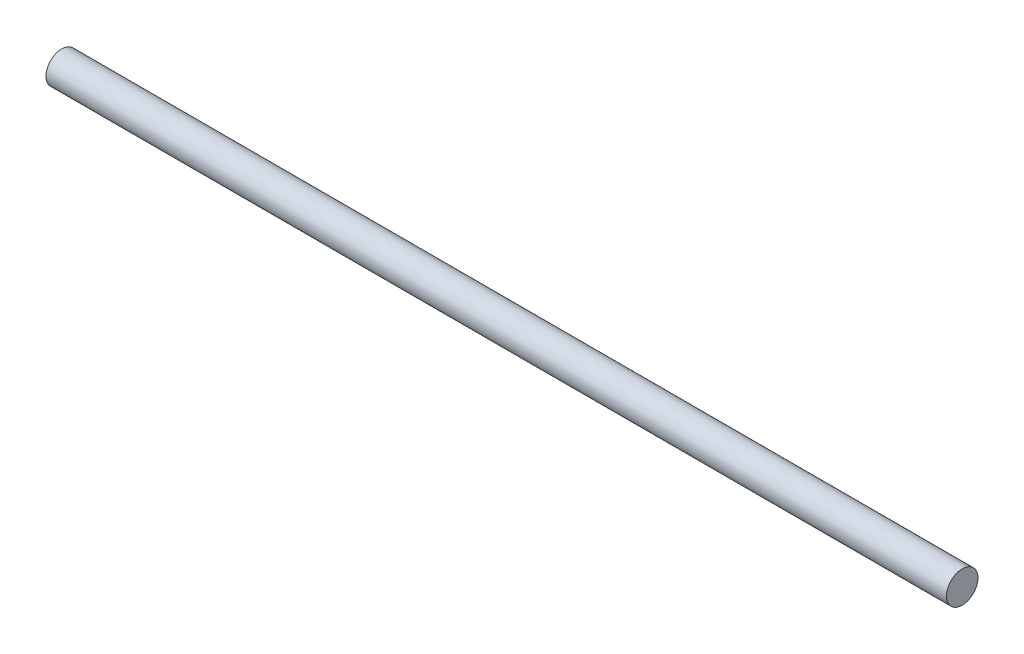
ISO-10303-21;
HEADER;
FILE_DESCRIPTION(('STEP AP214'),'2;1');
FILE_NAME('part.step','',(''),(''),'','','');
FILE_SCHEMA(('AUTOMOTIVE_DESIGN { 1 0 10303 214 1 1 1 1 }'));
ENDSEC;
DATA;
#1=APPLICATION_CONTEXT('core data for automotive mechanical design processes');
#2=APPLICATION_PROTOCOL_DEFINITION('international standard','automotive_design',2000,#1);
#3=PRODUCT_CONTEXT('',#1,'mechanical');
#4=PRODUCT('Part','Part','',(#3));
#5=PRODUCT_RELATED_PRODUCT_CATEGORY('part','',(#4));
#6=PRODUCT_DEFINITION_FORMATION('','',#4);
#7=PRODUCT_DEFINITION_CONTEXT('part definition',#1,'design');
#8=PRODUCT_DEFINITION('design','',#6,#7);
#9=PRODUCT_DEFINITION_SHAPE('','',#8);
#10=(LENGTH_UNIT() NAMED_UNIT(*) SI_UNIT(.MILLI.,.METRE.));
#11=(NAMED_UNIT(*) PLANE_ANGLE_UNIT() SI_UNIT($,.RADIAN.));
#12=(NAMED_UNIT(*) SI_UNIT($,.STERADIAN.) SOLID_ANGLE_UNIT());
#13=UNCERTAINTY_MEASURE_WITH_UNIT(LENGTH_MEASURE(1.E-05),#10,'distance_accuracy_value','');
#14=(GEOMETRIC_REPRESENTATION_CONTEXT(3) GLOBAL_UNCERTAINTY_ASSIGNED_CONTEXT((#13)) GLOBAL_UNIT_ASSIGNED_CONTEXT((#10,
#11,#12)) REPRESENTATION_CONTEXT('',''));
#15=CARTESIAN_POINT('',(0.,0.,0.));
#16=DIRECTION('',(0.,0.,1.));
#17=DIRECTION('',(1.,0.,0.));
#18=AXIS2_PLACEMENT_3D('',#15,#16,#17);
#19=CARTESIAN_POINT('',(151.69946076947,94.6994961131325,93.3382305336976));
#20=DIRECTION('',(1.,0.,0.));
#21=DIRECTION('',(0.,0.,-1.));
#22=AXIS2_PLACEMENT_3D('',#19,#20,#21);
#23=PLANE('',#22);
#24=CARTESIAN_POINT('',(151.69946076947,94.6994961131325,93.3382305336976));
#25=DIRECTION('',(1.,0.,0.));
#26=DIRECTION('',(0.,0.,-1.));
#27=AXIS2_PLACEMENT_3D('',#24,#25,#26);
#28=CIRCLE('',#27,0.875);
#29=CARTESIAN_POINT('',(151.69946076947,94.6994961131325,92.4632305336976));
#30=VERTEX_POINT('',#29);
#31=EDGE_CURVE('E18',#30,#30,#28,.F.);
#32=ORIENTED_EDGE('',*,*,#31,.F.);
#33=EDGE_LOOP('',(#32));
#34=FACE_BOUND('',#33,.T.);
#35=ADVANCED_FACE('F15',(#34),#23,.T.);
#36=CARTESIAN_POINT('',(101.69946076947,94.6994961131325,93.3382305336976));
#37=DIRECTION('',(1.,0.,0.));
#38=DIRECTION('',(0.,0.,-1.));
#39=AXIS2_PLACEMENT_3D('',#36,#37,#38);
#40=PLANE('',#39);
#41=CARTESIAN_POINT('',(101.69946076947,94.6994961131325,93.3382305336976));
#42=DIRECTION('',(1.,0.,0.));
#43=DIRECTION('',(0.,0.,-1.));
#44=AXIS2_PLACEMENT_3D('',#41,#42,#43);
#45=CIRCLE('',#44,0.875);
#46=CARTESIAN_POINT('',(101.69946076947,94.6994961131325,92.4632305336976));
#47=VERTEX_POINT('',#46);
#48=EDGE_CURVE('E10',#47,#47,#45,.T.);
#49=ORIENTED_EDGE('',*,*,#48,.F.);
#50=EDGE_LOOP('',(#49));
#51=FACE_BOUND('',#50,.T.);
#52=ADVANCED_FACE('F30',(#51),#40,.F.);
#53=CARTESIAN_POINT('',(126.69946076947,94.6994961131325,93.3382305336976));
#54=DIRECTION('',(1.,0.,0.));
#55=DIRECTION('',(0.,0.,-1.));
#56=AXIS2_PLACEMENT_3D('',#53,#54,#55);
#57=CYLINDRICAL_SURFACE('',#56,0.875);
#58=ORIENTED_EDGE('',*,*,#48,.T.);
#59=EDGE_LOOP('',(#58));
#60=FACE_BOUND('',#59,.T.);
#61=ORIENTED_EDGE('',*,*,#31,.T.);
#62=EDGE_LOOP('',(#61));
#63=FACE_BOUND('',#62,.T.);
#64=ADVANCED_FACE('F27',(#60,#63),#57,.T.);
#65=CLOSED_SHELL('',(#35,#52,#64));
#66=MANIFOLD_SOLID_BREP('B1',#65);
#67=ADVANCED_BREP_SHAPE_REPRESENTATION('',(#18,#66),#14);
#68=SHAPE_DEFINITION_REPRESENTATION(#9,#67);
ENDSEC;
END-ISO-10303-21;
